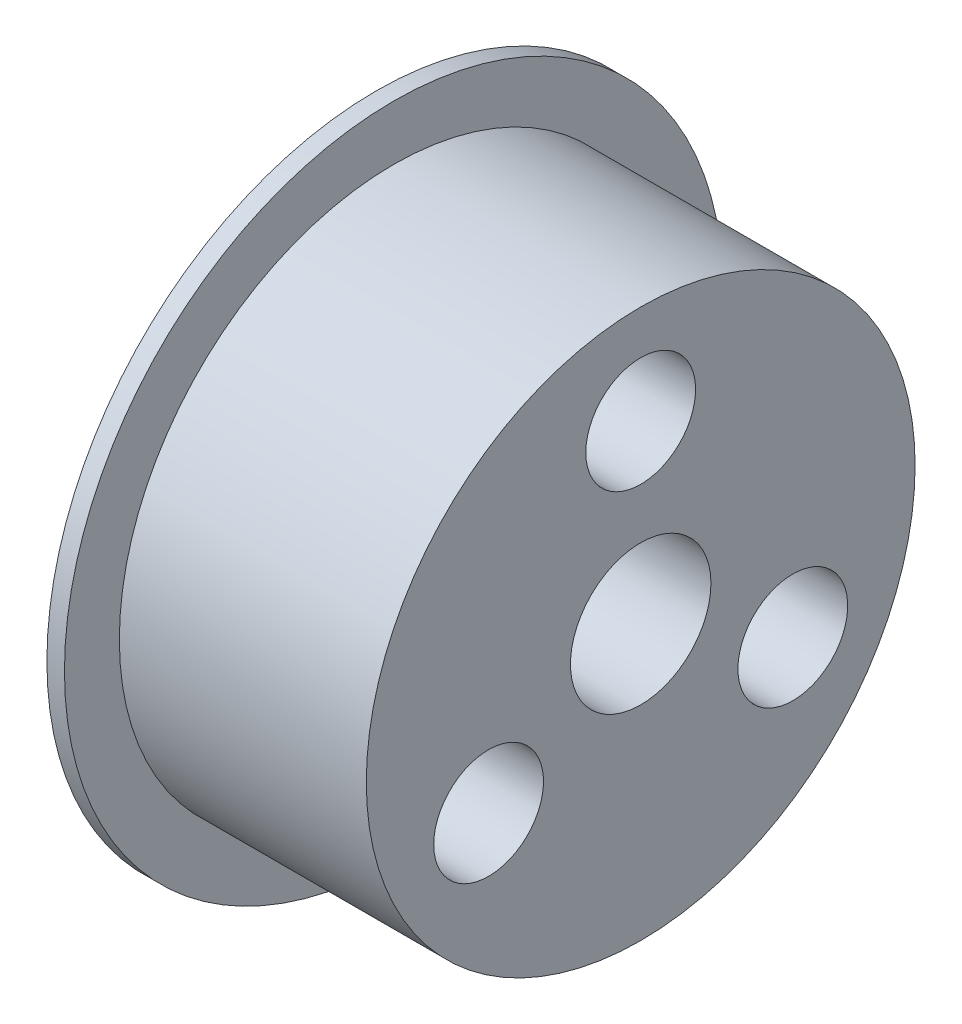
ISO-10303-21;
HEADER;
FILE_DESCRIPTION(('STEP AP214'),'2;1');
FILE_NAME('part.step','',(''),(''),'','','');
FILE_SCHEMA(('AUTOMOTIVE_DESIGN { 1 0 10303 214 1 1 1 1 }'));
ENDSEC;
DATA;
#1=APPLICATION_CONTEXT('core data for automotive mechanical design processes');
#2=APPLICATION_PROTOCOL_DEFINITION('international standard','automotive_design',2000,#1);
#3=PRODUCT_CONTEXT('',#1,'mechanical');
#4=PRODUCT('Part','Part','',(#3));
#5=PRODUCT_RELATED_PRODUCT_CATEGORY('part','',(#4));
#6=PRODUCT_DEFINITION_FORMATION('','',#4);
#7=PRODUCT_DEFINITION_CONTEXT('part definition',#1,'design');
#8=PRODUCT_DEFINITION('design','',#6,#7);
#9=PRODUCT_DEFINITION_SHAPE('','',#8);
#10=(LENGTH_UNIT() NAMED_UNIT(*) SI_UNIT(.MILLI.,.METRE.));
#11=(NAMED_UNIT(*) PLANE_ANGLE_UNIT() SI_UNIT($,.RADIAN.));
#12=(NAMED_UNIT(*) SI_UNIT($,.STERADIAN.) SOLID_ANGLE_UNIT());
#13=UNCERTAINTY_MEASURE_WITH_UNIT(LENGTH_MEASURE(1.E-05),#10,'distance_accuracy_value','');
#14=(GEOMETRIC_REPRESENTATION_CONTEXT(3) GLOBAL_UNCERTAINTY_ASSIGNED_CONTEXT((#13)) GLOBAL_UNIT_ASSIGNED_CONTEXT((#10,
#11,#12)) REPRESENTATION_CONTEXT('',''));
#15=CARTESIAN_POINT('',(0.,0.,0.));
#16=DIRECTION('',(0.,0.,1.));
#17=DIRECTION('',(1.,0.,0.));
#18=AXIS2_PLACEMENT_3D('',#15,#16,#17);
#19=CARTESIAN_POINT('',(0.,15.875,0.));
#20=DIRECTION('',(1.,0.,0.));
#21=DIRECTION('',(0.,0.,-1.));
#22=AXIS2_PLACEMENT_3D('',#19,#20,#21);
#23=PLANE('',#22);
#24=CARTESIAN_POINT('',(0.,10.16,0.));
#25=DIRECTION('',(-1.,0.,0.));
#26=DIRECTION('',(0.,0.,1.));
#27=AXIS2_PLACEMENT_3D('',#24,#25,#26);
#28=CIRCLE('',#27,3.175);
#29=CARTESIAN_POINT('',(0.,10.16,3.175));
#30=VERTEX_POINT('',#29);
#31=EDGE_CURVE('E76',#30,#30,#28,.T.);
#32=ORIENTED_EDGE('',*,*,#31,.T.);
#33=EDGE_LOOP('',(#32));
#34=FACE_BOUND('',#33,.T.);
#35=CARTESIAN_POINT('',(0.,-5.08,8.7988181024499));
#36=DIRECTION('',(-1.,0.,0.));
#37=DIRECTION('',(0.,0.,1.));
#38=AXIS2_PLACEMENT_3D('',#35,#36,#37);
#39=CIRCLE('',#38,3.175);
#40=CARTESIAN_POINT('',(0.,-5.08,11.9738181024499));
#41=VERTEX_POINT('',#40);
#42=EDGE_CURVE('E70',#41,#41,#39,.T.);
#43=ORIENTED_EDGE('',*,*,#42,.T.);
#44=EDGE_LOOP('',(#43));
#45=FACE_BOUND('',#44,.T.);
#46=CARTESIAN_POINT('',(0.,-5.08,-8.7988181024499));
#47=DIRECTION('',(-1.,0.,0.));
#48=DIRECTION('',(0.,0.,1.));
#49=AXIS2_PLACEMENT_3D('',#46,#47,#48);
#50=CIRCLE('',#49,3.175);
#51=CARTESIAN_POINT('',(0.,-5.08,-5.6238181024499));
#52=VERTEX_POINT('',#51);
#53=EDGE_CURVE('E64',#52,#52,#50,.T.);
#54=ORIENTED_EDGE('',*,*,#53,.T.);
#55=EDGE_LOOP('',(#54));
#56=FACE_BOUND('',#55,.T.);
#57=CARTESIAN_POINT('',(0.,0.,0.));
#58=DIRECTION('',(1.,0.,0.));
#59=DIRECTION('',(0.,0.,-1.));
#60=AXIS2_PLACEMENT_3D('',#57,#58,#59);
#61=CIRCLE('',#60,15.875);
#62=CARTESIAN_POINT('',(0.,0.,-15.875));
#63=VERTEX_POINT('',#62);
#64=EDGE_CURVE('E61',#63,#63,#61,.T.);
#65=ORIENTED_EDGE('',*,*,#64,.T.);
#66=EDGE_LOOP('',(#65));
#67=FACE_BOUND('',#66,.T.);
#68=CARTESIAN_POINT('',(0.,0.,0.));
#69=DIRECTION('',(1.,0.,0.));
#70=DIRECTION('',(0.,0.,-1.));
#71=AXIS2_PLACEMENT_3D('',#68,#69,#70);
#72=CIRCLE('',#71,4.064);
#73=CARTESIAN_POINT('',(0.,0.,-4.064));
#74=VERTEX_POINT('',#73);
#75=EDGE_CURVE('E10',#74,#74,#72,.T.);
#76=ORIENTED_EDGE('',*,*,#75,.F.);
#77=EDGE_LOOP('',(#76));
#78=FACE_BOUND('',#77,.T.);
#79=ADVANCED_FACE('F39',(#34,#45,#56,#67,#78),#23,.T.);
#80=CARTESIAN_POINT('',(0.,0.,0.));
#81=DIRECTION('',(1.,0.,0.));
#82=DIRECTION('',(0.,0.,-1.));
#83=AXIS2_PLACEMENT_3D('',#80,#81,#82);
#84=CYLINDRICAL_SURFACE('',#83,4.064);
#85=ORIENTED_EDGE('',*,*,#75,.T.);
#86=EDGE_LOOP('',(#85));
#87=FACE_BOUND('',#86,.T.);
#88=CARTESIAN_POINT('',(-15.3035,0.,0.));
#89=DIRECTION('',(1.,0.,0.));
#90=DIRECTION('',(0.,0.,-1.));
#91=AXIS2_PLACEMENT_3D('',#88,#89,#90);
#92=CIRCLE('',#91,4.064);
#93=CARTESIAN_POINT('',(-15.3035,0.,-4.064));
#94=VERTEX_POINT('',#93);
#95=EDGE_CURVE('E45',#94,#94,#92,.T.);
#96=ORIENTED_EDGE('',*,*,#95,.F.);
#97=EDGE_LOOP('',(#96));
#98=FACE_BOUND('',#97,.T.);
#99=ADVANCED_FACE('F89',(#87,#98),#84,.F.);
#100=CARTESIAN_POINT('',(-15.3035,4.064,0.));
#101=DIRECTION('',(-1.,0.,0.));
#102=DIRECTION('',(0.,0.,1.));
#103=AXIS2_PLACEMENT_3D('',#100,#101,#102);
#104=PLANE('',#103);
#105=CARTESIAN_POINT('',(-15.3035,10.16,0.));
#106=DIRECTION('',(-1.,0.,0.));
#107=DIRECTION('',(0.,0.,1.));
#108=AXIS2_PLACEMENT_3D('',#105,#106,#107);
#109=CIRCLE('',#108,3.175);
#110=CARTESIAN_POINT('',(-15.3035,10.16,3.175));
#111=VERTEX_POINT('',#110);
#112=EDGE_CURVE('E79',#111,#111,#109,.T.);
#113=ORIENTED_EDGE('',*,*,#112,.F.);
#114=EDGE_LOOP('',(#113));
#115=FACE_BOUND('',#114,.T.);
#116=CARTESIAN_POINT('',(-15.3035,-5.08,8.7988181024499));
#117=DIRECTION('',(-1.,0.,0.));
#118=DIRECTION('',(0.,0.,1.));
#119=AXIS2_PLACEMENT_3D('',#116,#117,#118);
#120=CIRCLE('',#119,3.175);
#121=CARTESIAN_POINT('',(-15.3035,-5.08,11.9738181024499));
#122=VERTEX_POINT('',#121);
#123=EDGE_CURVE('E73',#122,#122,#120,.T.);
#124=ORIENTED_EDGE('',*,*,#123,.F.);
#125=EDGE_LOOP('',(#124));
#126=FACE_BOUND('',#125,.T.);
#127=CARTESIAN_POINT('',(-15.3035,-5.08,-8.7988181024499));
#128=DIRECTION('',(-1.,0.,0.));
#129=DIRECTION('',(0.,0.,1.));
#130=AXIS2_PLACEMENT_3D('',#127,#128,#129);
#131=CIRCLE('',#130,3.175);
#132=CARTESIAN_POINT('',(-15.3035,-5.08,-5.6238181024499));
#133=VERTEX_POINT('',#132);
#134=EDGE_CURVE('E67',#133,#133,#131,.T.);
#135=ORIENTED_EDGE('',*,*,#134,.F.);
#136=EDGE_LOOP('',(#135));
#137=FACE_BOUND('',#136,.T.);
#138=ORIENTED_EDGE('',*,*,#95,.T.);
#139=EDGE_LOOP('',(#138));
#140=FACE_BOUND('',#139,.T.);
#141=CARTESIAN_POINT('',(-15.3035,0.,0.));
#142=DIRECTION('',(1.,0.,0.));
#143=DIRECTION('',(0.,0.,-1.));
#144=AXIS2_PLACEMENT_3D('',#141,#142,#143);
#145=CIRCLE('',#144,19.05);
#146=CARTESIAN_POINT('',(-15.3035,0.,-19.05));
#147=VERTEX_POINT('',#146);
#148=EDGE_CURVE('E49',#147,#147,#145,.T.);
#149=ORIENTED_EDGE('',*,*,#148,.F.);
#150=EDGE_LOOP('',(#149));
#151=FACE_BOUND('',#150,.T.);
#152=ADVANCED_FACE('F85',(#115,#126,#137,#140,#151),#104,.T.);
#153=CARTESIAN_POINT('',(0.,0.,0.));
#154=DIRECTION('',(1.,0.,0.));
#155=DIRECTION('',(0.,0.,-1.));
#156=AXIS2_PLACEMENT_3D('',#153,#154,#155);
#157=CYLINDRICAL_SURFACE('',#156,19.05);
#158=ORIENTED_EDGE('',*,*,#148,.T.);
#159=EDGE_LOOP('',(#158));
#160=FACE_BOUND('',#159,.T.);
#161=CARTESIAN_POINT('',(-14.2875,0.,0.));
#162=DIRECTION('',(1.,0.,0.));
#163=DIRECTION('',(0.,0.,-1.));
#164=AXIS2_PLACEMENT_3D('',#161,#162,#163);
#165=CIRCLE('',#164,19.05);
#166=CARTESIAN_POINT('',(-14.2875,0.,-19.05));
#167=VERTEX_POINT('',#166);
#168=EDGE_CURVE('E53',#167,#167,#165,.T.);
#169=ORIENTED_EDGE('',*,*,#168,.F.);
#170=EDGE_LOOP('',(#169));
#171=FACE_BOUND('',#170,.T.);
#172=ADVANCED_FACE('F88',(#160,#171),#157,.T.);
#173=CARTESIAN_POINT('',(-14.2875,19.05,0.));
#174=DIRECTION('',(1.,0.,0.));
#175=DIRECTION('',(0.,0.,-1.));
#176=AXIS2_PLACEMENT_3D('',#173,#174,#175);
#177=PLANE('',#176);
#178=ORIENTED_EDGE('',*,*,#168,.T.);
#179=EDGE_LOOP('',(#178));
#180=FACE_BOUND('',#179,.T.);
#181=CARTESIAN_POINT('',(-14.2875,0.,0.));
#182=DIRECTION('',(1.,0.,0.));
#183=DIRECTION('',(0.,0.,-1.));
#184=AXIS2_PLACEMENT_3D('',#181,#182,#183);
#185=CIRCLE('',#184,15.875);
#186=CARTESIAN_POINT('',(-14.2875,0.,-15.875));
#187=VERTEX_POINT('',#186);
#188=EDGE_CURVE('E58',#187,#187,#185,.T.);
#189=ORIENTED_EDGE('',*,*,#188,.F.);
#190=EDGE_LOOP('',(#189));
#191=FACE_BOUND('',#190,.T.);
#192=ADVANCED_FACE('F99',(#180,#191),#177,.T.);
#193=CARTESIAN_POINT('',(0.,0.,0.));
#194=DIRECTION('',(1.,0.,0.));
#195=DIRECTION('',(0.,0.,-1.));
#196=AXIS2_PLACEMENT_3D('',#193,#194,#195);
#197=CYLINDRICAL_SURFACE('',#196,15.875);
#198=ORIENTED_EDGE('',*,*,#188,.T.);
#199=EDGE_LOOP('',(#198));
#200=FACE_BOUND('',#199,.T.);
#201=ORIENTED_EDGE('',*,*,#64,.F.);
#202=EDGE_LOOP('',(#201));
#203=FACE_BOUND('',#202,.T.);
#204=ADVANCED_FACE('F105',(#200,#203),#197,.T.);
#205=CARTESIAN_POINT('',(-15.3035,-5.08,-8.7988181024499));
#206=DIRECTION('',(-1.,0.,0.));
#207=DIRECTION('',(0.,0.,1.));
#208=AXIS2_PLACEMENT_3D('',#205,#206,#207);
#209=CYLINDRICAL_SURFACE('',#208,3.175);
#210=ORIENTED_EDGE('',*,*,#53,.F.);
#211=EDGE_LOOP('',(#210));
#212=FACE_BOUND('',#211,.T.);
#213=ORIENTED_EDGE('',*,*,#134,.T.);
#214=EDGE_LOOP('',(#213));
#215=FACE_BOUND('',#214,.T.);
#216=ADVANCED_FACE('F111',(#212,#215),#209,.F.);
#217=CARTESIAN_POINT('',(-15.3035,-5.08,8.7988181024499));
#218=DIRECTION('',(-1.,0.,0.));
#219=DIRECTION('',(0.,0.,1.));
#220=AXIS2_PLACEMENT_3D('',#217,#218,#219);
#221=CYLINDRICAL_SURFACE('',#220,3.175);
#222=ORIENTED_EDGE('',*,*,#42,.F.);
#223=EDGE_LOOP('',(#222));
#224=FACE_BOUND('',#223,.T.);
#225=ORIENTED_EDGE('',*,*,#123,.T.);
#226=EDGE_LOOP('',(#225));
#227=FACE_BOUND('',#226,.T.);
#228=ADVANCED_FACE('F129',(#224,#227),#221,.F.);
#229=CARTESIAN_POINT('',(-15.3035,10.16,0.));
#230=DIRECTION('',(-1.,0.,0.));
#231=DIRECTION('',(0.,0.,1.));
#232=AXIS2_PLACEMENT_3D('',#229,#230,#231);
#233=CYLINDRICAL_SURFACE('',#232,3.175);
#234=ORIENTED_EDGE('',*,*,#31,.F.);
#235=EDGE_LOOP('',(#234));
#236=FACE_BOUND('',#235,.T.);
#237=ORIENTED_EDGE('',*,*,#112,.T.);
#238=EDGE_LOOP('',(#237));
#239=FACE_BOUND('',#238,.T.);
#240=ADVANCED_FACE('F83',(#236,#239),#233,.F.);
#241=CLOSED_SHELL('',(#79,#99,#152,#172,#192,#204,#216,#228,#240));
#242=MANIFOLD_SOLID_BREP('B2',#241);
#243=ADVANCED_BREP_SHAPE_REPRESENTATION('',(#18,#242),#14);
#244=SHAPE_DEFINITION_REPRESENTATION(#9,#243);
ENDSEC;
END-ISO-10303-21;
